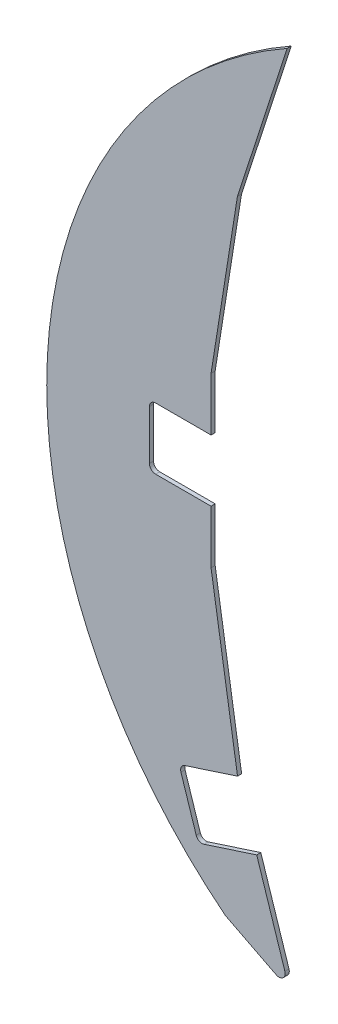
ISO-10303-21;
HEADER;
FILE_DESCRIPTION(('STEP AP214'),'2;1');
FILE_NAME('part.step','',(''),(''),'','','');
FILE_SCHEMA(('AUTOMOTIVE_DESIGN { 1 0 10303 214 1 1 1 1 }'));
ENDSEC;
DATA;
#1=APPLICATION_CONTEXT('core data for automotive mechanical design processes');
#2=APPLICATION_PROTOCOL_DEFINITION('international standard','automotive_design',2000,#1);
#3=PRODUCT_CONTEXT('',#1,'mechanical');
#4=PRODUCT('Part','Part','',(#3));
#5=PRODUCT_RELATED_PRODUCT_CATEGORY('part','',(#4));
#6=PRODUCT_DEFINITION_FORMATION('','',#4);
#7=PRODUCT_DEFINITION_CONTEXT('part definition',#1,'design');
#8=PRODUCT_DEFINITION('design','',#6,#7);
#9=PRODUCT_DEFINITION_SHAPE('','',#8);
#10=(LENGTH_UNIT() NAMED_UNIT(*) SI_UNIT(.MILLI.,.METRE.));
#11=(NAMED_UNIT(*) PLANE_ANGLE_UNIT() SI_UNIT($,.RADIAN.));
#12=(NAMED_UNIT(*) SI_UNIT($,.STERADIAN.) SOLID_ANGLE_UNIT());
#13=UNCERTAINTY_MEASURE_WITH_UNIT(LENGTH_MEASURE(1.E-05),#10,'distance_accuracy_value','');
#14=(GEOMETRIC_REPRESENTATION_CONTEXT(3) GLOBAL_UNCERTAINTY_ASSIGNED_CONTEXT((#13)) GLOBAL_UNIT_ASSIGNED_CONTEXT((#10,
#11,#12)) REPRESENTATION_CONTEXT('',''));
#15=CARTESIAN_POINT('',(0.,0.,0.));
#16=DIRECTION('',(0.,0.,1.));
#17=DIRECTION('',(1.,0.,0.));
#18=AXIS2_PLACEMENT_3D('',#15,#16,#17);
#19=CARTESIAN_POINT('',(151.770445180093,-3.90276159878121,-2.));
#20=DIRECTION('',(0.,0.,1.));
#21=DIRECTION('',(1.,0.,0.));
#22=AXIS2_PLACEMENT_3D('',#19,#20,#21);
#23=CYLINDRICAL_SURFACE('',#22,230.159366149146);
#24=CARTESIAN_POINT('',(151.770445180093,-3.90276159878121,0.));
#25=DIRECTION('',(0.,0.,1.));
#26=DIRECTION('',(1.,0.,0.));
#27=AXIS2_PLACEMENT_3D('',#24,#25,#26);
#28=CIRCLE('',#27,230.159366149146);
#29=CARTESIAN_POINT('',(38.6599035344823,196.545084971875,0.));
#30=VERTEX_POINT('',#29);
#31=CARTESIAN_POINT('',(8.59724512933855,-184.110332509116,0.));
#32=VERTEX_POINT('',#31);
#33=EDGE_CURVE('E201',#30,#32,#28,.T.);
#34=ORIENTED_EDGE('',*,*,#33,.F.);
#35=DIRECTION('',(0.,0.,1.));
#36=VECTOR('',#35,1.);
#37=CARTESIAN_POINT('',(38.6599035344823,196.545084971875,-2.));
#38=LINE('',#37,#36);
#39=CARTESIAN_POINT('',(38.6599035344823,196.545084971875,-2.));
#40=VERTEX_POINT('',#39);
#41=EDGE_CURVE('E11',#40,#30,#38,.T.);
#42=ORIENTED_EDGE('',*,*,#41,.F.);
#43=CARTESIAN_POINT('',(151.770445180093,-3.90276159878121,-2.));
#44=DIRECTION('',(0.,0.,1.));
#45=DIRECTION('',(1.,0.,0.));
#46=AXIS2_PLACEMENT_3D('',#43,#44,#45);
#47=CIRCLE('',#46,230.159366149146);
#48=CARTESIAN_POINT('',(8.59724512933855,-184.110332509116,-2.));
#49=VERTEX_POINT('',#48);
#50=EDGE_CURVE('E254',#40,#49,#47,.T.);
#51=ORIENTED_EDGE('',*,*,#50,.T.);
#52=DIRECTION('',(0.,0.,1.));
#53=VECTOR('',#52,1.);
#54=CARTESIAN_POINT('',(8.59724512933855,-184.110332509116,-2.));
#55=LINE('',#54,#53);
#56=EDGE_CURVE('E41',#49,#32,#55,.T.);
#57=ORIENTED_EDGE('',*,*,#56,.T.);
#58=EDGE_LOOP('',(#34,#42,#51,#57));
#59=FACE_BOUND('',#58,.T.);
#60=ADVANCED_FACE('F38',(#59),#23,.T.);
#61=CARTESIAN_POINT('',(14.4401754899926,122.004426694486,-2.));
#62=DIRECTION('',(0.951056516295154,-0.309016994374946,0.));
#63=DIRECTION('',(0.309016994374946,0.951056516295154,0.));
#64=AXIS2_PLACEMENT_3D('',#61,#62,#63);
#65=PLANE('',#64);
#66=DIRECTION('',(0.309016994374946,0.951056516295154,0.));
#67=VECTOR('',#66,1.);
#68=CARTESIAN_POINT('',(14.4401754899926,122.004426694486,0.));
#69=LINE('',#68,#67);
#70=CARTESIAN_POINT('',(14.4401754899926,122.004426694486,0.));
#71=VERTEX_POINT('',#70);
#72=EDGE_CURVE('E252',#71,#30,#69,.T.);
#73=ORIENTED_EDGE('',*,*,#72,.F.);
#74=DIRECTION('',(0.,0.,1.));
#75=VECTOR('',#74,1.);
#76=CARTESIAN_POINT('',(14.4401754899926,122.004426694486,-2.));
#77=LINE('',#76,#75);
#78=CARTESIAN_POINT('',(14.4401754899926,122.004426694486,-2.));
#79=VERTEX_POINT('',#78);
#80=EDGE_CURVE('E47',#79,#71,#77,.T.);
#81=ORIENTED_EDGE('',*,*,#80,.F.);
#82=DIRECTION('',(0.309016994374946,0.951056516295154,0.));
#83=VECTOR('',#82,1.);
#84=CARTESIAN_POINT('',(14.4401754899926,122.004426694486,-2.));
#85=LINE('',#84,#83);
#86=EDGE_CURVE('E191',#79,#40,#85,.T.);
#87=ORIENTED_EDGE('',*,*,#86,.T.);
#88=ORIENTED_EDGE('',*,*,#41,.T.);
#89=EDGE_LOOP('',(#73,#81,#87,#88));
#90=FACE_BOUND('',#89,.T.);
#91=ADVANCED_FACE('F288',(#90),#65,.T.);
#92=CARTESIAN_POINT('',(1.61107903094744,41.004699494277,-2.));
#93=DIRECTION('',(0.987688340595138,-0.156434465040229,0.));
#94=DIRECTION('',(0.156434465040229,0.987688340595138,0.));
#95=AXIS2_PLACEMENT_3D('',#92,#93,#94);
#96=PLANE('',#95);
#97=DIRECTION('',(0.156434465040229,0.987688340595138,0.));
#98=VECTOR('',#97,1.);
#99=CARTESIAN_POINT('',(1.61107903094744,41.004699494277,0.));
#100=LINE('',#99,#98);
#101=CARTESIAN_POINT('',(1.61107903094744,41.004699494277,0.));
#102=VERTEX_POINT('',#101);
#103=EDGE_CURVE('E178',#102,#71,#100,.T.);
#104=ORIENTED_EDGE('',*,*,#103,.F.);
#105=DIRECTION('',(0.,0.,1.));
#106=VECTOR('',#105,1.);
#107=CARTESIAN_POINT('',(1.61107903094744,41.004699494277,-2.));
#108=LINE('',#107,#106);
#109=CARTESIAN_POINT('',(1.61107903094744,41.004699494277,-2.));
#110=VERTEX_POINT('',#109);
#111=EDGE_CURVE('E173',#110,#102,#108,.T.);
#112=ORIENTED_EDGE('',*,*,#111,.F.);
#113=DIRECTION('',(0.156434465040229,0.987688340595138,0.));
#114=VECTOR('',#113,1.);
#115=CARTESIAN_POINT('',(1.61107903094744,41.004699494277,-2.));
#116=LINE('',#115,#114);
#117=EDGE_CURVE('E176',#110,#79,#116,.T.);
#118=ORIENTED_EDGE('',*,*,#117,.T.);
#119=ORIENTED_EDGE('',*,*,#80,.T.);
#120=EDGE_LOOP('',(#104,#112,#118,#119));
#121=FACE_BOUND('',#120,.T.);
#122=ADVANCED_FACE('F175',(#121),#96,.T.);
#123=CARTESIAN_POINT('',(1.61107903094744,15.,-2.));
#124=DIRECTION('',(1.,0.,0.));
#125=DIRECTION('',(0.,1.,0.));
#126=AXIS2_PLACEMENT_3D('',#123,#124,#125);
#127=PLANE('',#126);
#128=DIRECTION('',(0.,1.,0.));
#129=VECTOR('',#128,1.);
#130=CARTESIAN_POINT('',(1.61107903094744,15.,0.));
#131=LINE('',#130,#129);
#132=CARTESIAN_POINT('',(1.61107903094744,15.,0.));
#133=VERTEX_POINT('',#132);
#134=EDGE_CURVE('E249',#133,#102,#131,.T.);
#135=ORIENTED_EDGE('',*,*,#134,.F.);
#136=DIRECTION('',(0.,0.,1.));
#137=VECTOR('',#136,1.);
#138=CARTESIAN_POINT('',(1.61107903094744,15.,-2.));
#139=LINE('',#138,#137);
#140=CARTESIAN_POINT('',(1.61107903094744,15.,-2.));
#141=VERTEX_POINT('',#140);
#142=EDGE_CURVE('E183',#141,#133,#139,.T.);
#143=ORIENTED_EDGE('',*,*,#142,.F.);
#144=DIRECTION('',(0.,1.,0.));
#145=VECTOR('',#144,1.);
#146=CARTESIAN_POINT('',(1.61107903094744,15.,-2.));
#147=LINE('',#146,#145);
#148=EDGE_CURVE('E189',#141,#110,#147,.T.);
#149=ORIENTED_EDGE('',*,*,#148,.T.);
#150=ORIENTED_EDGE('',*,*,#111,.T.);
#151=EDGE_LOOP('',(#135,#143,#149,#150));
#152=FACE_BOUND('',#151,.T.);
#153=ADVANCED_FACE('F193',(#152),#127,.T.);
#154=CARTESIAN_POINT('',(-25.3889209690525,15.,-2.));
#155=DIRECTION('',(0.,-1.,0.));
#156=DIRECTION('',(0.,0.,-1.));
#157=AXIS2_PLACEMENT_3D('',#154,#155,#156);
#158=PLANE('',#157);
#159=DIRECTION('',(1.,0.,0.));
#160=VECTOR('',#159,1.);
#161=CARTESIAN_POINT('',(-25.3889209690525,15.,0.));
#162=LINE('',#161,#160);
#163=CARTESIAN_POINT('',(-25.3889209690525,15.,0.));
#164=VERTEX_POINT('',#163);
#165=EDGE_CURVE('E246',#164,#133,#162,.T.);
#166=ORIENTED_EDGE('',*,*,#165,.F.);
#167=DIRECTION('',(0.,0.,1.));
#168=VECTOR('',#167,1.);
#169=CARTESIAN_POINT('',(-25.3889209690525,15.,-2.));
#170=LINE('',#169,#168);
#171=CARTESIAN_POINT('',(-25.3889209690525,15.,-2.));
#172=VERTEX_POINT('',#171);
#173=EDGE_CURVE('E258',#172,#164,#170,.T.);
#174=ORIENTED_EDGE('',*,*,#173,.F.);
#175=DIRECTION('',(1.,0.,0.));
#176=VECTOR('',#175,1.);
#177=CARTESIAN_POINT('',(-25.3889209690525,15.,-2.));
#178=LINE('',#177,#176);
#179=EDGE_CURVE('E194',#172,#141,#178,.T.);
#180=ORIENTED_EDGE('',*,*,#179,.T.);
#181=ORIENTED_EDGE('',*,*,#142,.T.);
#182=EDGE_LOOP('',(#166,#174,#180,#181));
#183=FACE_BOUND('',#182,.T.);
#184=ADVANCED_FACE('F301',(#183),#158,.T.);
#185=CARTESIAN_POINT('',(-25.3889209690526,12.,-2.));
#186=DIRECTION('',(0.,0.,1.));
#187=DIRECTION('',(1.,0.,0.));
#188=AXIS2_PLACEMENT_3D('',#185,#186,#187);
#189=CYLINDRICAL_SURFACE('',#188,3.);
#190=CARTESIAN_POINT('',(-25.3889209690526,12.,0.));
#191=DIRECTION('',(0.,0.,-1.));
#192=DIRECTION('',(1.,0.,0.));
#193=AXIS2_PLACEMENT_3D('',#190,#191,#192);
#194=CIRCLE('',#193,3.);
#195=CARTESIAN_POINT('',(-28.3889209690526,12.,0.));
#196=VERTEX_POINT('',#195);
#197=EDGE_CURVE('E243',#196,#164,#194,.T.);
#198=ORIENTED_EDGE('',*,*,#197,.F.);
#199=DIRECTION('',(0.,0.,1.));
#200=VECTOR('',#199,1.);
#201=CARTESIAN_POINT('',(-28.3889209690526,12.,-2.));
#202=LINE('',#201,#200);
#203=CARTESIAN_POINT('',(-28.3889209690526,12.,-2.));
#204=VERTEX_POINT('',#203);
#205=EDGE_CURVE('E260',#204,#196,#202,.T.);
#206=ORIENTED_EDGE('',*,*,#205,.F.);
#207=CARTESIAN_POINT('',(-25.3889209690526,12.,-2.));
#208=DIRECTION('',(0.,0.,-1.));
#209=DIRECTION('',(1.,0.,0.));
#210=AXIS2_PLACEMENT_3D('',#207,#208,#209);
#211=CIRCLE('',#210,3.);
#212=EDGE_CURVE('E196',#204,#172,#211,.T.);
#213=ORIENTED_EDGE('',*,*,#212,.T.);
#214=ORIENTED_EDGE('',*,*,#173,.T.);
#215=EDGE_LOOP('',(#198,#206,#213,#214));
#216=FACE_BOUND('',#215,.T.);
#217=ADVANCED_FACE('F304',(#216),#189,.F.);
#218=CARTESIAN_POINT('',(-28.3889209690526,12.,-2.));
#219=DIRECTION('',(1.,0.,0.));
#220=DIRECTION('',(0.,0.,-1.));
#221=AXIS2_PLACEMENT_3D('',#218,#219,#220);
#222=PLANE('',#221);
#223=DIRECTION('',(0.,1.,0.));
#224=VECTOR('',#223,1.);
#225=CARTESIAN_POINT('',(-28.3889209690526,12.,0.));
#226=LINE('',#225,#224);
#227=CARTESIAN_POINT('',(-28.3889209690526,-12.,0.));
#228=VERTEX_POINT('',#227);
#229=EDGE_CURVE('E240',#228,#196,#226,.T.);
#230=ORIENTED_EDGE('',*,*,#229,.F.);
#231=DIRECTION('',(0.,0.,1.));
#232=VECTOR('',#231,1.);
#233=CARTESIAN_POINT('',(-28.3889209690526,-12.,-2.));
#234=LINE('',#233,#232);
#235=CARTESIAN_POINT('',(-28.3889209690526,-12.,-2.));
#236=VERTEX_POINT('',#235);
#237=EDGE_CURVE('E262',#236,#228,#234,.T.);
#238=ORIENTED_EDGE('',*,*,#237,.F.);
#239=DIRECTION('',(0.,1.,0.));
#240=VECTOR('',#239,1.);
#241=CARTESIAN_POINT('',(-28.3889209690526,12.,-2.));
#242=LINE('',#241,#240);
#243=EDGE_CURVE('E568',#236,#204,#242,.T.);
#244=ORIENTED_EDGE('',*,*,#243,.T.);
#245=ORIENTED_EDGE('',*,*,#205,.T.);
#246=EDGE_LOOP('',(#230,#238,#244,#245));
#247=FACE_BOUND('',#246,.T.);
#248=ADVANCED_FACE('F308',(#247),#222,.T.);
#249=CARTESIAN_POINT('',(-25.3889209690526,-12.,-2.));
#250=DIRECTION('',(0.,0.,1.));
#251=DIRECTION('',(1.,0.,0.));
#252=AXIS2_PLACEMENT_3D('',#249,#250,#251);
#253=CYLINDRICAL_SURFACE('',#252,3.);
#254=CARTESIAN_POINT('',(-25.3889209690526,-12.,0.));
#255=DIRECTION('',(0.,0.,-1.));
#256=DIRECTION('',(1.,0.,0.));
#257=AXIS2_PLACEMENT_3D('',#254,#255,#256);
#258=CIRCLE('',#257,3.);
#259=CARTESIAN_POINT('',(-25.3889209690526,-15.,0.));
#260=VERTEX_POINT('',#259);
#261=EDGE_CURVE('E237',#260,#228,#258,.T.);
#262=ORIENTED_EDGE('',*,*,#261,.F.);
#263=DIRECTION('',(0.,0.,1.));
#264=VECTOR('',#263,1.);
#265=CARTESIAN_POINT('',(-25.3889209690526,-15.,-2.));
#266=LINE('',#265,#264);
#267=CARTESIAN_POINT('',(-25.3889209690526,-15.,-2.));
#268=VERTEX_POINT('',#267);
#269=EDGE_CURVE('E264',#268,#260,#266,.T.);
#270=ORIENTED_EDGE('',*,*,#269,.F.);
#271=CARTESIAN_POINT('',(-25.3889209690526,-12.,-2.));
#272=DIRECTION('',(0.,0.,-1.));
#273=DIRECTION('',(1.,0.,0.));
#274=AXIS2_PLACEMENT_3D('',#271,#272,#273);
#275=CIRCLE('',#274,3.);
#276=EDGE_CURVE('E564',#268,#236,#275,.T.);
#277=ORIENTED_EDGE('',*,*,#276,.T.);
#278=ORIENTED_EDGE('',*,*,#237,.T.);
#279=EDGE_LOOP('',(#262,#270,#277,#278));
#280=FACE_BOUND('',#279,.T.);
#281=ADVANCED_FACE('F312',(#280),#253,.F.);
#282=CARTESIAN_POINT('',(1.61107903094744,-15.,-2.));
#283=DIRECTION('',(0.,1.,0.));
#284=DIRECTION('',(0.,0.,1.));
#285=AXIS2_PLACEMENT_3D('',#282,#283,#284);
#286=PLANE('',#285);
#287=DIRECTION('',(-1.,0.,0.));
#288=VECTOR('',#287,1.);
#289=CARTESIAN_POINT('',(1.61107903094744,-15.,0.));
#290=LINE('',#289,#288);
#291=CARTESIAN_POINT('',(1.61107903094744,-15.,0.));
#292=VERTEX_POINT('',#291);
#293=EDGE_CURVE('E234',#292,#260,#290,.T.);
#294=ORIENTED_EDGE('',*,*,#293,.F.);
#295=DIRECTION('',(0.,0.,1.));
#296=VECTOR('',#295,1.);
#297=CARTESIAN_POINT('',(1.61107903094744,-15.,-2.));
#298=LINE('',#297,#296);
#299=CARTESIAN_POINT('',(1.61107903094744,-15.,-2.));
#300=VERTEX_POINT('',#299);
#301=EDGE_CURVE('E266',#300,#292,#298,.T.);
#302=ORIENTED_EDGE('',*,*,#301,.F.);
#303=DIRECTION('',(-1.,0.,0.));
#304=VECTOR('',#303,1.);
#305=CARTESIAN_POINT('',(1.61107903094744,-15.,-2.));
#306=LINE('',#305,#304);
#307=EDGE_CURVE('E575',#300,#268,#306,.T.);
#308=ORIENTED_EDGE('',*,*,#307,.T.);
#309=ORIENTED_EDGE('',*,*,#269,.T.);
#310=EDGE_LOOP('',(#294,#302,#308,#309));
#311=FACE_BOUND('',#310,.T.);
#312=ADVANCED_FACE('F316',(#311),#286,.T.);
#313=CARTESIAN_POINT('',(1.61107903094744,-41.0046994942771,-2.));
#314=DIRECTION('',(1.,0.,0.));
#315=DIRECTION('',(0.,0.,-1.));
#316=AXIS2_PLACEMENT_3D('',#313,#314,#315);
#317=PLANE('',#316);
#318=DIRECTION('',(0.,1.,0.));
#319=VECTOR('',#318,1.);
#320=CARTESIAN_POINT('',(1.61107903094744,-41.0046994942771,0.));
#321=LINE('',#320,#319);
#322=CARTESIAN_POINT('',(1.61107903094744,-41.0046994942771,0.));
#323=VERTEX_POINT('',#322);
#324=EDGE_CURVE('E231',#323,#292,#321,.T.);
#325=ORIENTED_EDGE('',*,*,#324,.F.);
#326=DIRECTION('',(0.,0.,1.));
#327=VECTOR('',#326,1.);
#328=CARTESIAN_POINT('',(1.61107903094744,-41.0046994942771,-2.));
#329=LINE('',#328,#327);
#330=CARTESIAN_POINT('',(1.61107903094744,-41.0046994942771,-2.));
#331=VERTEX_POINT('',#330);
#332=EDGE_CURVE('E268',#331,#323,#329,.T.);
#333=ORIENTED_EDGE('',*,*,#332,.F.);
#334=DIRECTION('',(0.,1.,0.));
#335=VECTOR('',#334,1.);
#336=CARTESIAN_POINT('',(1.61107903094744,-41.0046994942771,-2.));
#337=LINE('',#336,#335);
#338=EDGE_CURVE('E557',#331,#300,#337,.T.);
#339=ORIENTED_EDGE('',*,*,#338,.T.);
#340=ORIENTED_EDGE('',*,*,#301,.T.);
#341=EDGE_LOOP('',(#325,#333,#339,#340));
#342=FACE_BOUND('',#341,.T.);
#343=ADVANCED_FACE('F320',(#342),#317,.T.);
#344=CARTESIAN_POINT('',(14.5025011189325,-122.397935228609,-2.));
#345=DIRECTION('',(0.987688340595138,0.15643446504023,0.));
#346=DIRECTION('',(-0.15643446504023,0.987688340595138,0.));
#347=AXIS2_PLACEMENT_3D('',#344,#345,#346);
#348=PLANE('',#347);
#349=DIRECTION('',(-0.15643446504023,0.987688340595138,0.));
#350=VECTOR('',#349,1.);
#351=CARTESIAN_POINT('',(14.5025011189325,-122.397935228609,0.));
#352=LINE('',#351,#350);
#353=CARTESIAN_POINT('',(14.5025011189325,-122.397935228609,0.));
#354=VERTEX_POINT('',#353);
#355=EDGE_CURVE('E228',#354,#323,#352,.T.);
#356=ORIENTED_EDGE('',*,*,#355,.F.);
#357=DIRECTION('',(0.,0.,1.));
#358=VECTOR('',#357,1.);
#359=CARTESIAN_POINT('',(14.5025011189325,-122.397935228609,-2.));
#360=LINE('',#359,#358);
#361=CARTESIAN_POINT('',(14.5025011189325,-122.397935228609,-2.));
#362=VERTEX_POINT('',#361);
#363=EDGE_CURVE('E270',#362,#354,#360,.T.);
#364=ORIENTED_EDGE('',*,*,#363,.F.);
#365=DIRECTION('',(-0.15643446504023,0.987688340595138,0.));
#366=VECTOR('',#365,1.);
#367=CARTESIAN_POINT('',(14.5025011189325,-122.397935228609,-2.));
#368=LINE('',#367,#366);
#369=EDGE_CURVE('E553',#362,#331,#368,.T.);
#370=ORIENTED_EDGE('',*,*,#369,.T.);
#371=ORIENTED_EDGE('',*,*,#332,.T.);
#372=EDGE_LOOP('',(#356,#364,#370,#371));
#373=FACE_BOUND('',#372,.T.);
#374=ADVANCED_FACE('F324',(#373),#348,.T.);
#375=CARTESIAN_POINT('',(-11.1167496255012,-130.722134398205,-2.));
#376=DIRECTION('',(0.309016994374945,-0.951056516295155,0.));
#377=DIRECTION('',(0.951056516295155,0.309016994374945,0.));
#378=AXIS2_PLACEMENT_3D('',#375,#376,#377);
#379=PLANE('',#378);
#380=DIRECTION('',(0.951056516295155,0.309016994374945,0.));
#381=VECTOR('',#380,1.);
#382=CARTESIAN_POINT('',(-11.1167496255012,-130.722134398205,0.));
#383=LINE('',#382,#381);
#384=CARTESIAN_POINT('',(-11.1167496255012,-130.722134398205,0.));
#385=VERTEX_POINT('',#384);
#386=EDGE_CURVE('E225',#385,#354,#383,.T.);
#387=ORIENTED_EDGE('',*,*,#386,.F.);
#388=DIRECTION('',(0.,0.,1.));
#389=VECTOR('',#388,1.);
#390=CARTESIAN_POINT('',(-11.1167496255012,-130.722134398205,-2.));
#391=LINE('',#390,#389);
#392=CARTESIAN_POINT('',(-11.1167496255012,-130.722134398205,-2.));
#393=VERTEX_POINT('',#392);
#394=EDGE_CURVE('E272',#393,#385,#391,.T.);
#395=ORIENTED_EDGE('',*,*,#394,.F.);
#396=DIRECTION('',(0.951056516295155,0.309016994374945,0.));
#397=VECTOR('',#396,1.);
#398=CARTESIAN_POINT('',(-11.1167496255012,-130.722134398205,-2.));
#399=LINE('',#398,#397);
#400=EDGE_CURVE('E579',#393,#362,#399,.T.);
#401=ORIENTED_EDGE('',*,*,#400,.T.);
#402=ORIENTED_EDGE('',*,*,#363,.T.);
#403=EDGE_LOOP('',(#387,#395,#401,#402));
#404=FACE_BOUND('',#403,.T.);
#405=ADVANCED_FACE('F328',(#404),#379,.T.);
#406=CARTESIAN_POINT('',(-10.1896986423764,-133.57530394709,-2.));
#407=DIRECTION('',(0.,0.,1.));
#408=DIRECTION('',(1.,0.,0.));
#409=AXIS2_PLACEMENT_3D('',#406,#407,#408);
#410=CYLINDRICAL_SURFACE('',#409,3.);
#411=CARTESIAN_POINT('',(-10.1896986423764,-133.57530394709,0.));
#412=DIRECTION('',(0.,0.,-1.));
#413=DIRECTION('',(1.,0.,0.));
#414=AXIS2_PLACEMENT_3D('',#411,#412,#413);
#415=CIRCLE('',#414,3.);
#416=CARTESIAN_POINT('',(-13.0428681912618,-134.502354930215,0.));
#417=VERTEX_POINT('',#416);
#418=EDGE_CURVE('E222',#417,#385,#415,.T.);
#419=ORIENTED_EDGE('',*,*,#418,.F.);
#420=DIRECTION('',(0.,0.,1.));
#421=VECTOR('',#420,1.);
#422=CARTESIAN_POINT('',(-13.0428681912618,-134.502354930215,-2.));
#423=LINE('',#422,#421);
#424=CARTESIAN_POINT('',(-13.0428681912618,-134.502354930215,-2.));
#425=VERTEX_POINT('',#424);
#426=EDGE_CURVE('E274',#425,#417,#423,.T.);
#427=ORIENTED_EDGE('',*,*,#426,.F.);
#428=CARTESIAN_POINT('',(-10.1896986423764,-133.57530394709,-2.));
#429=DIRECTION('',(0.,0.,-1.));
#430=DIRECTION('',(1.,0.,0.));
#431=AXIS2_PLACEMENT_3D('',#428,#429,#430);
#432=CIRCLE('',#431,3.);
#433=EDGE_CURVE('E546',#425,#393,#432,.T.);
#434=ORIENTED_EDGE('',*,*,#433,.T.);
#435=ORIENTED_EDGE('',*,*,#394,.T.);
#436=EDGE_LOOP('',(#419,#427,#434,#435));
#437=FACE_BOUND('',#436,.T.);
#438=ADVANCED_FACE('F332',(#437),#410,.F.);
#439=CARTESIAN_POINT('',(-13.0428681912618,-134.502354930215,-2.));
#440=DIRECTION('',(0.951056516295154,0.309016994374945,0.));
#441=DIRECTION('',(-0.309016994374945,0.951056516295155,0.));
#442=AXIS2_PLACEMENT_3D('',#439,#440,#441);
#443=PLANE('',#442);
#444=DIRECTION('',(-0.309016994374945,0.951056516295154,0.));
#445=VECTOR('',#444,1.);
#446=CARTESIAN_POINT('',(-13.0428681912618,-134.502354930215,0.));
#447=LINE('',#446,#445);
#448=CARTESIAN_POINT('',(-5.62646032626313,-157.327711321299,0.));
#449=VERTEX_POINT('',#448);
#450=EDGE_CURVE('E219',#449,#417,#447,.T.);
#451=ORIENTED_EDGE('',*,*,#450,.F.);
#452=DIRECTION('',(0.,0.,1.));
#453=VECTOR('',#452,1.);
#454=CARTESIAN_POINT('',(-5.62646032626313,-157.327711321299,-2.));
#455=LINE('',#454,#453);
#456=CARTESIAN_POINT('',(-5.62646032626313,-157.327711321299,-2.));
#457=VERTEX_POINT('',#456);
#458=EDGE_CURVE('E276',#457,#449,#455,.T.);
#459=ORIENTED_EDGE('',*,*,#458,.F.);
#460=DIRECTION('',(-0.309016994374945,0.951056516295154,0.));
#461=VECTOR('',#460,1.);
#462=CARTESIAN_POINT('',(-13.0428681912618,-134.502354930215,-2.));
#463=LINE('',#462,#461);
#464=EDGE_CURVE('E542',#457,#425,#463,.T.);
#465=ORIENTED_EDGE('',*,*,#464,.T.);
#466=ORIENTED_EDGE('',*,*,#426,.T.);
#467=EDGE_LOOP('',(#451,#459,#465,#466));
#468=FACE_BOUND('',#467,.T.);
#469=ADVANCED_FACE('F336',(#468),#443,.T.);
#470=CARTESIAN_POINT('',(-2.77329077737767,-156.400660338174,-2.));
#471=DIRECTION('',(0.,0.,1.));
#472=DIRECTION('',(1.,0.,0.));
#473=AXIS2_PLACEMENT_3D('',#470,#471,#472);
#474=CYLINDRICAL_SURFACE('',#473,2.99999999999999);
#475=CARTESIAN_POINT('',(-2.77329077737767,-156.400660338174,0.));
#476=DIRECTION('',(0.,0.,-1.));
#477=DIRECTION('',(1.,0.,0.));
#478=AXIS2_PLACEMENT_3D('',#475,#476,#477);
#479=CIRCLE('',#478,2.99999999999999);
#480=CARTESIAN_POINT('',(-1.84623979425283,-159.25382988706,0.));
#481=VERTEX_POINT('',#480);
#482=EDGE_CURVE('E216',#481,#449,#479,.T.);
#483=ORIENTED_EDGE('',*,*,#482,.F.);
#484=DIRECTION('',(0.,0.,1.));
#485=VECTOR('',#484,1.);
#486=CARTESIAN_POINT('',(-1.84623979425283,-159.25382988706,-2.));
#487=LINE('',#486,#485);
#488=CARTESIAN_POINT('',(-1.84623979425283,-159.25382988706,-2.));
#489=VERTEX_POINT('',#488);
#490=EDGE_CURVE('E278',#489,#481,#487,.T.);
#491=ORIENTED_EDGE('',*,*,#490,.F.);
#492=CARTESIAN_POINT('',(-2.77329077737767,-156.400660338174,-2.));
#493=DIRECTION('',(0.,0.,-1.));
#494=DIRECTION('',(1.,0.,0.));
#495=AXIS2_PLACEMENT_3D('',#492,#493,#494);
#496=CIRCLE('',#495,2.99999999999999);
#497=EDGE_CURVE('E583',#489,#457,#496,.T.);
#498=ORIENTED_EDGE('',*,*,#497,.T.);
#499=ORIENTED_EDGE('',*,*,#458,.T.);
#500=EDGE_LOOP('',(#483,#491,#498,#499));
#501=FACE_BOUND('',#500,.T.);
#502=ADVANCED_FACE('F340',(#501),#474,.F.);
#503=CARTESIAN_POINT('',(23.8322861457164,-150.910371038936,-2.));
#504=DIRECTION('',(-0.309016994374945,0.951056516295155,0.));
#505=DIRECTION('',(-0.951056516295155,-0.309016994374945,0.));
#506=AXIS2_PLACEMENT_3D('',#503,#504,#505);
#507=PLANE('',#506);
#508=DIRECTION('',(-0.951056516295155,-0.309016994374945,0.));
#509=VECTOR('',#508,1.);
#510=CARTESIAN_POINT('',(23.8322861457164,-150.910371038936,0.));
#511=LINE('',#510,#509);
#512=CARTESIAN_POINT('',(23.8322861457164,-150.910371038936,0.));
#513=VERTEX_POINT('',#512);
#514=EDGE_CURVE('E213',#513,#481,#511,.T.);
#515=ORIENTED_EDGE('',*,*,#514,.F.);
#516=DIRECTION('',(0.,0.,1.));
#517=VECTOR('',#516,1.);
#518=CARTESIAN_POINT('',(23.8322861457164,-150.910371038936,-2.));
#519=LINE('',#518,#517);
#520=CARTESIAN_POINT('',(23.8322861457164,-150.910371038936,-2.));
#521=VERTEX_POINT('',#520);
#522=EDGE_CURVE('E280',#521,#513,#519,.T.);
#523=ORIENTED_EDGE('',*,*,#522,.F.);
#524=DIRECTION('',(-0.951056516295155,-0.309016994374945,0.));
#525=VECTOR('',#524,1.);
#526=CARTESIAN_POINT('',(23.8322861457164,-150.910371038936,-2.));
#527=LINE('',#526,#525);
#528=EDGE_CURVE('E535',#521,#489,#527,.T.);
#529=ORIENTED_EDGE('',*,*,#528,.T.);
#530=ORIENTED_EDGE('',*,*,#490,.T.);
#531=EDGE_LOOP('',(#515,#523,#529,#530));
#532=FACE_BOUND('',#531,.T.);
#533=ADVANCED_FACE('F344',(#532),#507,.T.);
#534=CARTESIAN_POINT('',(37.54437441946,-193.111839379331,-2.));
#535=DIRECTION('',(0.951056516295154,0.309016994374945,0.));
#536=DIRECTION('',(-0.309016994374945,0.951056516295155,0.));
#537=AXIS2_PLACEMENT_3D('',#534,#535,#536);
#538=PLANE('',#537);
#539=DIRECTION('',(-0.309016994374945,0.951056516295154,0.));
#540=VECTOR('',#539,1.);
#541=CARTESIAN_POINT('',(37.54437441946,-193.111839379331,0.));
#542=LINE('',#541,#540);
#543=CARTESIAN_POINT('',(37.54437441946,-193.111839379331,0.));
#544=VERTEX_POINT('',#543);
#545=EDGE_CURVE('E210',#544,#513,#542,.T.);
#546=ORIENTED_EDGE('',*,*,#545,.F.);
#547=DIRECTION('',(0.,0.,1.));
#548=VECTOR('',#547,1.);
#549=CARTESIAN_POINT('',(37.54437441946,-193.111839379331,-2.));
#550=LINE('',#549,#548);
#551=CARTESIAN_POINT('',(37.54437441946,-193.111839379331,-2.));
#552=VERTEX_POINT('',#551);
#553=EDGE_CURVE('E282',#552,#544,#550,.T.);
#554=ORIENTED_EDGE('',*,*,#553,.F.);
#555=DIRECTION('',(-0.309016994374945,0.951056516295154,0.));
#556=VECTOR('',#555,1.);
#557=CARTESIAN_POINT('',(37.54437441946,-193.111839379331,-2.));
#558=LINE('',#557,#556);
#559=EDGE_CURVE('E531',#552,#521,#558,.T.);
#560=ORIENTED_EDGE('',*,*,#559,.T.);
#561=ORIENTED_EDGE('',*,*,#522,.T.);
#562=EDGE_LOOP('',(#546,#554,#560,#561));
#563=FACE_BOUND('',#562,.T.);
#564=ADVANCED_FACE('F348',(#563),#538,.T.);
#565=CARTESIAN_POINT('',(34.6912048705745,-194.038890362456,-2.));
#566=DIRECTION('',(0.,0.,1.));
#567=DIRECTION('',(1.,0.,0.));
#568=AXIS2_PLACEMENT_3D('',#565,#566,#567);
#569=CYLINDRICAL_SURFACE('',#568,3.00000000000001);
#570=CARTESIAN_POINT('',(34.6912048705745,-194.038890362456,0.));
#571=DIRECTION('',(0.,0.,1.));
#572=DIRECTION('',(1.,0.,0.));
#573=AXIS2_PLACEMENT_3D('',#570,#571,#572);
#574=CIRCLE('',#573,3.00000000000001);
#575=CARTESIAN_POINT('',(33.3292333713559,-196.711909935021,0.));
#576=VERTEX_POINT('',#575);
#577=EDGE_CURVE('E207',#576,#544,#574,.T.);
#578=ORIENTED_EDGE('',*,*,#577,.F.);
#579=DIRECTION('',(0.,0.,1.));
#580=VECTOR('',#579,1.);
#581=CARTESIAN_POINT('',(33.3292333713559,-196.711909935021,-2.));
#582=LINE('',#581,#580);
#583=CARTESIAN_POINT('',(33.3292333713559,-196.711909935021,-2.));
#584=VERTEX_POINT('',#583);
#585=EDGE_CURVE('E283',#584,#576,#582,.T.);
#586=ORIENTED_EDGE('',*,*,#585,.F.);
#587=CARTESIAN_POINT('',(34.6912048705745,-194.038890362456,-2.));
#588=DIRECTION('',(0.,0.,1.));
#589=DIRECTION('',(1.,0.,0.));
#590=AXIS2_PLACEMENT_3D('',#587,#588,#589);
#591=CIRCLE('',#590,3.00000000000001);
#592=EDGE_CURVE('E587',#584,#552,#591,.T.);
#593=ORIENTED_EDGE('',*,*,#592,.T.);
#594=ORIENTED_EDGE('',*,*,#553,.T.);
#595=EDGE_LOOP('',(#578,#586,#593,#594));
#596=FACE_BOUND('',#595,.T.);
#597=ADVANCED_FACE('F352',(#596),#569,.T.);
#598=CARTESIAN_POINT('',(33.3292333713558,-196.711909935021,-2.));
#599=DIRECTION('',(-0.453990499739555,-0.891006524188364,0.));
#600=DIRECTION('',(0.891006524188364,-0.453990499739555,0.));
#601=AXIS2_PLACEMENT_3D('',#598,#599,#600);
#602=PLANE('',#601);
#603=DIRECTION('',(0.891006524188364,-0.453990499739555,0.));
#604=VECTOR('',#603,1.);
#605=CARTESIAN_POINT('',(33.3292333713558,-196.711909935021,0.));
#606=LINE('',#605,#604);
#607=EDGE_CURVE('E204',#32,#576,#606,.T.);
#608=ORIENTED_EDGE('',*,*,#607,.F.);
#609=ORIENTED_EDGE('',*,*,#56,.F.);
#610=DIRECTION('',(0.891006524188364,-0.453990499739555,0.));
#611=VECTOR('',#610,1.);
#612=CARTESIAN_POINT('',(33.3292333713558,-196.711909935021,-2.));
#613=LINE('',#612,#611);
#614=EDGE_CURVE('E589',#49,#584,#613,.T.);
#615=ORIENTED_EDGE('',*,*,#614,.T.);
#616=ORIENTED_EDGE('',*,*,#585,.T.);
#617=EDGE_LOOP('',(#608,#609,#615,#616));
#618=FACE_BOUND('',#617,.T.);
#619=ADVANCED_FACE('F285',(#618),#602,.T.);
#620=CARTESIAN_POINT('',(151.770445180093,-3.90276159878121,-2.));
#621=DIRECTION('',(0.,0.,1.));
#622=DIRECTION('',(1.,0.,0.));
#623=AXIS2_PLACEMENT_3D('',#620,#621,#622);
#624=PLANE('',#623);
#625=ORIENTED_EDGE('',*,*,#50,.F.);
#626=ORIENTED_EDGE('',*,*,#86,.F.);
#627=ORIENTED_EDGE('',*,*,#117,.F.);
#628=ORIENTED_EDGE('',*,*,#148,.F.);
#629=ORIENTED_EDGE('',*,*,#179,.F.);
#630=ORIENTED_EDGE('',*,*,#212,.F.);
#631=ORIENTED_EDGE('',*,*,#243,.F.);
#632=ORIENTED_EDGE('',*,*,#276,.F.);
#633=ORIENTED_EDGE('',*,*,#307,.F.);
#634=ORIENTED_EDGE('',*,*,#338,.F.);
#635=ORIENTED_EDGE('',*,*,#369,.F.);
#636=ORIENTED_EDGE('',*,*,#400,.F.);
#637=ORIENTED_EDGE('',*,*,#433,.F.);
#638=ORIENTED_EDGE('',*,*,#464,.F.);
#639=ORIENTED_EDGE('',*,*,#497,.F.);
#640=ORIENTED_EDGE('',*,*,#528,.F.);
#641=ORIENTED_EDGE('',*,*,#559,.F.);
#642=ORIENTED_EDGE('',*,*,#592,.F.);
#643=ORIENTED_EDGE('',*,*,#614,.F.);
#644=EDGE_LOOP('',(#625,#626,#627,#628,#629,#630,#631,#632,#633,#634,#635,#636,#637,#638,#639,
#640,#641,#642,#643));
#645=FACE_BOUND('',#644,.T.);
#646=ADVANCED_FACE('F187',(#645),#624,.F.);
#647=CARTESIAN_POINT('',(151.770445180093,-3.90276159878121,0.));
#648=DIRECTION('',(0.,0.,1.));
#649=DIRECTION('',(1.,0.,0.));
#650=AXIS2_PLACEMENT_3D('',#647,#648,#649);
#651=PLANE('',#650);
#652=ORIENTED_EDGE('',*,*,#33,.T.);
#653=ORIENTED_EDGE('',*,*,#607,.T.);
#654=ORIENTED_EDGE('',*,*,#577,.T.);
#655=ORIENTED_EDGE('',*,*,#545,.T.);
#656=ORIENTED_EDGE('',*,*,#514,.T.);
#657=ORIENTED_EDGE('',*,*,#482,.T.);
#658=ORIENTED_EDGE('',*,*,#450,.T.);
#659=ORIENTED_EDGE('',*,*,#418,.T.);
#660=ORIENTED_EDGE('',*,*,#386,.T.);
#661=ORIENTED_EDGE('',*,*,#355,.T.);
#662=ORIENTED_EDGE('',*,*,#324,.T.);
#663=ORIENTED_EDGE('',*,*,#293,.T.);
#664=ORIENTED_EDGE('',*,*,#261,.T.);
#665=ORIENTED_EDGE('',*,*,#229,.T.);
#666=ORIENTED_EDGE('',*,*,#197,.T.);
#667=ORIENTED_EDGE('',*,*,#165,.T.);
#668=ORIENTED_EDGE('',*,*,#134,.T.);
#669=ORIENTED_EDGE('',*,*,#103,.T.);
#670=ORIENTED_EDGE('',*,*,#72,.T.);
#671=EDGE_LOOP('',(#652,#653,#654,#655,#656,#657,#658,#659,#660,#661,#662,#663,#664,#665,#666,
#667,#668,#669,#670));
#672=FACE_BOUND('',#671,.T.);
#673=ADVANCED_FACE('F287',(#672),#651,.T.);
#674=CLOSED_SHELL('',(#60,#91,#122,#153,#184,#217,#248,#281,#312,#343,#374,#405,#438,#469,#502,
#533,#564,#597,#619,#646,#673));
#675=MANIFOLD_SOLID_BREP('B2',#674);
#676=ADVANCED_BREP_SHAPE_REPRESENTATION('',(#18,#675),#14);
#677=SHAPE_DEFINITION_REPRESENTATION(#9,#676);
ENDSEC;
END-ISO-10303-21;
